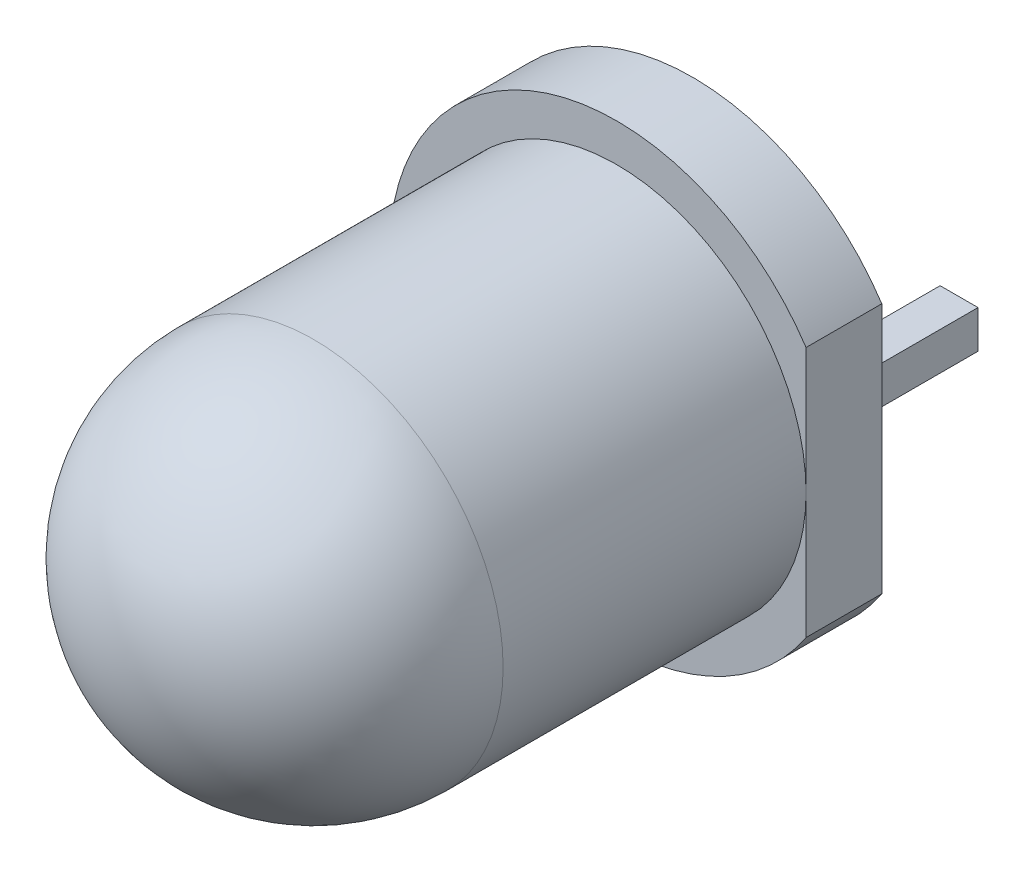
ISO-10303-21;
HEADER;
FILE_DESCRIPTION(('STEP AP214'),'2;1');
FILE_NAME('part.step','',(''),(''),'','','');
FILE_SCHEMA(('AUTOMOTIVE_DESIGN { 1 0 10303 214 1 1 1 1 }'));
ENDSEC;
DATA;
#1=APPLICATION_CONTEXT('core data for automotive mechanical design processes');
#2=APPLICATION_PROTOCOL_DEFINITION('international standard','automotive_design',2000,#1);
#3=PRODUCT_CONTEXT('',#1,'mechanical');
#4=PRODUCT('Part','Part','',(#3));
#5=PRODUCT_RELATED_PRODUCT_CATEGORY('part','',(#4));
#6=PRODUCT_DEFINITION_FORMATION('','',#4);
#7=PRODUCT_DEFINITION_CONTEXT('part definition',#1,'design');
#8=PRODUCT_DEFINITION('design','',#6,#7);
#9=PRODUCT_DEFINITION_SHAPE('','',#8);
#10=(LENGTH_UNIT() NAMED_UNIT(*) SI_UNIT(.MILLI.,.METRE.));
#11=(NAMED_UNIT(*) PLANE_ANGLE_UNIT() SI_UNIT($,.RADIAN.));
#12=(NAMED_UNIT(*) SI_UNIT($,.STERADIAN.) SOLID_ANGLE_UNIT());
#13=UNCERTAINTY_MEASURE_WITH_UNIT(LENGTH_MEASURE(1.E-05),#10,'distance_accuracy_value','');
#14=(GEOMETRIC_REPRESENTATION_CONTEXT(3) GLOBAL_UNCERTAINTY_ASSIGNED_CONTEXT((#13)) GLOBAL_UNIT_ASSIGNED_CONTEXT((#10,
#11,#12)) REPRESENTATION_CONTEXT('',''));
#15=CARTESIAN_POINT('',(0.,0.,0.));
#16=DIRECTION('',(0.,0.,1.));
#17=DIRECTION('',(1.,0.,0.));
#18=AXIS2_PLACEMENT_3D('',#15,#16,#17);
#19=CARTESIAN_POINT('',(1.77,0.25,0.));
#20=DIRECTION('',(-1.,0.,0.));
#21=DIRECTION('',(0.,-1.,0.));
#22=AXIS2_PLACEMENT_3D('',#19,#20,#21);
#23=PLANE('',#22);
#24=DIRECTION('',(0.,0.,-1.));
#25=VECTOR('',#24,1.);
#26=CARTESIAN_POINT('',(1.77,-0.25,0.));
#27=LINE('',#26,#25);
#28=CARTESIAN_POINT('',(1.77,-0.25,0.));
#29=VERTEX_POINT('',#28);
#30=CARTESIAN_POINT('',(1.77,-0.25,-2.));
#31=VERTEX_POINT('',#30);
#32=EDGE_CURVE('E114',#29,#31,#27,.T.);
#33=ORIENTED_EDGE('',*,*,#32,.T.);
#34=DIRECTION('',(0.,-1.,0.));
#35=VECTOR('',#34,1.);
#36=CARTESIAN_POINT('',(1.77,0.25,-2.));
#37=LINE('',#36,#35);
#38=CARTESIAN_POINT('',(1.77,0.25,-2.));
#39=VERTEX_POINT('',#38);
#40=EDGE_CURVE('E12',#39,#31,#37,.T.);
#41=ORIENTED_EDGE('',*,*,#40,.F.);
#42=DIRECTION('',(0.,0.,-1.));
#43=VECTOR('',#42,1.);
#44=CARTESIAN_POINT('',(1.77,0.25,0.));
#45=LINE('',#44,#43);
#46=CARTESIAN_POINT('',(1.77,0.25,0.));
#47=VERTEX_POINT('',#46);
#48=EDGE_CURVE('E91',#47,#39,#45,.T.);
#49=ORIENTED_EDGE('',*,*,#48,.F.);
#50=DIRECTION('',(0.,-1.,0.));
#51=VECTOR('',#50,1.);
#52=CARTESIAN_POINT('',(1.77,0.25,0.));
#53=LINE('',#52,#51);
#54=EDGE_CURVE('E67',#47,#29,#53,.T.);
#55=ORIENTED_EDGE('',*,*,#54,.T.);
#56=EDGE_LOOP('',(#33,#41,#49,#55));
#57=FACE_BOUND('',#56,.T.);
#58=ADVANCED_FACE('F51',(#57),#23,.F.);
#59=CARTESIAN_POINT('',(1.27,0.25,-2.));
#60=DIRECTION('',(0.,0.,-1.));
#61=DIRECTION('',(-1.,0.,0.));
#62=AXIS2_PLACEMENT_3D('',#59,#60,#61);
#63=PLANE('',#62);
#64=DIRECTION('',(1.,0.,0.));
#65=VECTOR('',#64,1.);
#66=CARTESIAN_POINT('',(1.27,-0.25,-2.));
#67=LINE('',#66,#65);
#68=CARTESIAN_POINT('',(1.27,-0.25,-2.));
#69=VERTEX_POINT('',#68);
#70=EDGE_CURVE('E100',#69,#31,#67,.T.);
#71=ORIENTED_EDGE('',*,*,#70,.F.);
#72=DIRECTION('',(0.,-1.,0.));
#73=VECTOR('',#72,1.);
#74=CARTESIAN_POINT('',(1.27,0.25,-2.));
#75=LINE('',#74,#73);
#76=CARTESIAN_POINT('',(1.27,0.25,-2.));
#77=VERTEX_POINT('',#76);
#78=EDGE_CURVE('E59',#77,#69,#75,.T.);
#79=ORIENTED_EDGE('',*,*,#78,.F.);
#80=DIRECTION('',(1.,0.,0.));
#81=VECTOR('',#80,1.);
#82=CARTESIAN_POINT('',(1.27,0.25,-2.));
#83=LINE('',#82,#81);
#84=EDGE_CURVE('E98',#77,#39,#83,.T.);
#85=ORIENTED_EDGE('',*,*,#84,.T.);
#86=ORIENTED_EDGE('',*,*,#40,.T.);
#87=EDGE_LOOP('',(#71,#79,#85,#86));
#88=FACE_BOUND('',#87,.T.);
#89=ADVANCED_FACE('F97',(#88),#63,.T.);
#90=CARTESIAN_POINT('',(1.27,0.25,0.));
#91=DIRECTION('',(-1.,0.,0.));
#92=DIRECTION('',(0.,-1.,0.));
#93=AXIS2_PLACEMENT_3D('',#90,#91,#92);
#94=PLANE('',#93);
#95=DIRECTION('',(0.,0.,-1.));
#96=VECTOR('',#95,1.);
#97=CARTESIAN_POINT('',(1.27,-0.25,0.));
#98=LINE('',#97,#96);
#99=CARTESIAN_POINT('',(1.27,-0.25,0.));
#100=VERTEX_POINT('',#99);
#101=EDGE_CURVE('E117',#100,#69,#98,.T.);
#102=ORIENTED_EDGE('',*,*,#101,.F.);
#103=DIRECTION('',(0.,-1.,0.));
#104=VECTOR('',#103,1.);
#105=CARTESIAN_POINT('',(1.27,0.25,0.));
#106=LINE('',#105,#104);
#107=CARTESIAN_POINT('',(1.27,0.25,0.));
#108=VERTEX_POINT('',#107);
#109=EDGE_CURVE('E80',#108,#100,#106,.T.);
#110=ORIENTED_EDGE('',*,*,#109,.F.);
#111=DIRECTION('',(0.,0.,-1.));
#112=VECTOR('',#111,1.);
#113=CARTESIAN_POINT('',(1.27,0.25,0.));
#114=LINE('',#113,#112);
#115=EDGE_CURVE('E106',#108,#77,#114,.T.);
#116=ORIENTED_EDGE('',*,*,#115,.T.);
#117=ORIENTED_EDGE('',*,*,#78,.T.);
#118=EDGE_LOOP('',(#102,#110,#116,#117));
#119=FACE_BOUND('',#118,.T.);
#120=ADVANCED_FACE('F108',(#119),#94,.T.);
#121=CARTESIAN_POINT('',(1.77,0.25,0.));
#122=DIRECTION('',(0.,0.,1.));
#123=DIRECTION('',(1.,0.,0.));
#124=AXIS2_PLACEMENT_3D('',#121,#122,#123);
#125=PLANE('',#124);
#126=DIRECTION('',(-1.,0.,0.));
#127=VECTOR('',#126,1.);
#128=CARTESIAN_POINT('',(1.77,-0.25,0.));
#129=LINE('',#128,#127);
#130=EDGE_CURVE('E119',#29,#100,#129,.T.);
#131=ORIENTED_EDGE('',*,*,#130,.F.);
#132=ORIENTED_EDGE('',*,*,#54,.F.);
#133=DIRECTION('',(-1.,0.,0.));
#134=VECTOR('',#133,1.);
#135=CARTESIAN_POINT('',(1.77,0.25,0.));
#136=LINE('',#135,#134);
#137=EDGE_CURVE('E109',#47,#108,#136,.T.);
#138=ORIENTED_EDGE('',*,*,#137,.T.);
#139=ORIENTED_EDGE('',*,*,#109,.T.);
#140=EDGE_LOOP('',(#131,#132,#138,#139));
#141=FACE_BOUND('',#140,.T.);
#142=ADVANCED_FACE('F125',(#141),#125,.T.);
#143=CARTESIAN_POINT('',(0.,0.25,0.));
#144=DIRECTION('',(0.,-1.,0.));
#145=DIRECTION('',(-1.,0.,0.));
#146=AXIS2_PLACEMENT_3D('',#143,#144,#145);
#147=PLANE('',#146);
#148=ORIENTED_EDGE('',*,*,#48,.T.);
#149=ORIENTED_EDGE('',*,*,#84,.F.);
#150=ORIENTED_EDGE('',*,*,#115,.F.);
#151=ORIENTED_EDGE('',*,*,#137,.F.);
#152=EDGE_LOOP('',(#148,#149,#150,#151));
#153=FACE_BOUND('',#152,.T.);
#154=ADVANCED_FACE('F105',(#153),#147,.F.);
#155=CARTESIAN_POINT('',(0.,-0.25,0.));
#156=DIRECTION('',(0.,-1.,0.));
#157=DIRECTION('',(-1.,0.,0.));
#158=AXIS2_PLACEMENT_3D('',#155,#156,#157);
#159=PLANE('',#158);
#160=ORIENTED_EDGE('',*,*,#32,.F.);
#161=ORIENTED_EDGE('',*,*,#130,.T.);
#162=ORIENTED_EDGE('',*,*,#101,.T.);
#163=ORIENTED_EDGE('',*,*,#70,.T.);
#164=EDGE_LOOP('',(#160,#161,#162,#163));
#165=FACE_BOUND('',#164,.T.);
#166=ADVANCED_FACE('F124',(#165),#159,.T.);
#167=CLOSED_SHELL('',(#58,#89,#120,#142,#154,#166));
#168=MANIFOLD_SOLID_BREP('B2',#167);
#169=CARTESIAN_POINT('',(-0.77,0.25,0.));
#170=DIRECTION('',(-1.,0.,0.));
#171=DIRECTION('',(0.,-1.,0.));
#172=AXIS2_PLACEMENT_3D('',#169,#170,#171);
#173=PLANE('',#172);
#174=DIRECTION('',(0.,0.,-1.));
#175=VECTOR('',#174,1.);
#176=CARTESIAN_POINT('',(-0.77,-0.25,0.));
#177=LINE('',#176,#175);
#178=CARTESIAN_POINT('',(-0.77,-0.25,0.));
#179=VERTEX_POINT('',#178);
#180=CARTESIAN_POINT('',(-0.77,-0.25,-2.));
#181=VERTEX_POINT('',#180);
#182=EDGE_CURVE('E260',#179,#181,#177,.T.);
#183=ORIENTED_EDGE('',*,*,#182,.T.);
#184=DIRECTION('',(0.,-1.,0.));
#185=VECTOR('',#184,1.);
#186=CARTESIAN_POINT('',(-0.77,0.25,-2.));
#187=LINE('',#186,#185);
#188=CARTESIAN_POINT('',(-0.77,0.25,-2.));
#189=VERTEX_POINT('',#188);
#190=EDGE_CURVE('E49',#189,#181,#187,.T.);
#191=ORIENTED_EDGE('',*,*,#190,.F.);
#192=DIRECTION('',(0.,0.,-1.));
#193=VECTOR('',#192,1.);
#194=CARTESIAN_POINT('',(-0.77,0.25,0.));
#195=LINE('',#194,#193);
#196=CARTESIAN_POINT('',(-0.77,0.25,0.));
#197=VERTEX_POINT('',#196);
#198=EDGE_CURVE('E237',#197,#189,#195,.T.);
#199=ORIENTED_EDGE('',*,*,#198,.F.);
#200=DIRECTION('',(0.,-1.,0.));
#201=VECTOR('',#200,1.);
#202=CARTESIAN_POINT('',(-0.77,0.25,0.));
#203=LINE('',#202,#201);
#204=EDGE_CURVE('E213',#197,#179,#203,.T.);
#205=ORIENTED_EDGE('',*,*,#204,.T.);
#206=EDGE_LOOP('',(#183,#191,#199,#205));
#207=FACE_BOUND('',#206,.T.);
#208=ADVANCED_FACE('F197',(#207),#173,.F.);
#209=CARTESIAN_POINT('',(-1.27,0.25,-2.));
#210=DIRECTION('',(0.,0.,-1.));
#211=DIRECTION('',(-1.,0.,0.));
#212=AXIS2_PLACEMENT_3D('',#209,#210,#211);
#213=PLANE('',#212);
#214=DIRECTION('',(1.,0.,0.));
#215=VECTOR('',#214,1.);
#216=CARTESIAN_POINT('',(-1.27,-0.25,-2.));
#217=LINE('',#216,#215);
#218=CARTESIAN_POINT('',(-1.27,-0.25,-2.));
#219=VERTEX_POINT('',#218);
#220=EDGE_CURVE('E246',#219,#181,#217,.T.);
#221=ORIENTED_EDGE('',*,*,#220,.F.);
#222=DIRECTION('',(0.,-1.,0.));
#223=VECTOR('',#222,1.);
#224=CARTESIAN_POINT('',(-1.27,0.25,-2.));
#225=LINE('',#224,#223);
#226=CARTESIAN_POINT('',(-1.27,0.25,-2.));
#227=VERTEX_POINT('',#226);
#228=EDGE_CURVE('E205',#227,#219,#225,.T.);
#229=ORIENTED_EDGE('',*,*,#228,.F.);
#230=DIRECTION('',(1.,0.,0.));
#231=VECTOR('',#230,1.);
#232=CARTESIAN_POINT('',(-1.27,0.25,-2.));
#233=LINE('',#232,#231);
#234=EDGE_CURVE('E244',#227,#189,#233,.T.);
#235=ORIENTED_EDGE('',*,*,#234,.T.);
#236=ORIENTED_EDGE('',*,*,#190,.T.);
#237=EDGE_LOOP('',(#221,#229,#235,#236));
#238=FACE_BOUND('',#237,.T.);
#239=ADVANCED_FACE('F243',(#238),#213,.T.);
#240=CARTESIAN_POINT('',(-1.27,0.25,0.));
#241=DIRECTION('',(-1.,0.,0.));
#242=DIRECTION('',(0.,-1.,0.));
#243=AXIS2_PLACEMENT_3D('',#240,#241,#242);
#244=PLANE('',#243);
#245=DIRECTION('',(0.,0.,-1.));
#246=VECTOR('',#245,1.);
#247=CARTESIAN_POINT('',(-1.27,-0.25,0.));
#248=LINE('',#247,#246);
#249=CARTESIAN_POINT('',(-1.27,-0.25,0.));
#250=VERTEX_POINT('',#249);
#251=EDGE_CURVE('E263',#250,#219,#248,.T.);
#252=ORIENTED_EDGE('',*,*,#251,.F.);
#253=DIRECTION('',(0.,-1.,0.));
#254=VECTOR('',#253,1.);
#255=CARTESIAN_POINT('',(-1.27,0.25,0.));
#256=LINE('',#255,#254);
#257=CARTESIAN_POINT('',(-1.27,0.25,0.));
#258=VERTEX_POINT('',#257);
#259=EDGE_CURVE('E226',#258,#250,#256,.T.);
#260=ORIENTED_EDGE('',*,*,#259,.F.);
#261=DIRECTION('',(0.,0.,-1.));
#262=VECTOR('',#261,1.);
#263=CARTESIAN_POINT('',(-1.27,0.25,0.));
#264=LINE('',#263,#262);
#265=EDGE_CURVE('E252',#258,#227,#264,.T.);
#266=ORIENTED_EDGE('',*,*,#265,.T.);
#267=ORIENTED_EDGE('',*,*,#228,.T.);
#268=EDGE_LOOP('',(#252,#260,#266,#267));
#269=FACE_BOUND('',#268,.T.);
#270=ADVANCED_FACE('F254',(#269),#244,.T.);
#271=CARTESIAN_POINT('',(-0.77,0.25,0.));
#272=DIRECTION('',(0.,0.,1.));
#273=DIRECTION('',(1.,0.,0.));
#274=AXIS2_PLACEMENT_3D('',#271,#272,#273);
#275=PLANE('',#274);
#276=DIRECTION('',(-1.,0.,0.));
#277=VECTOR('',#276,1.);
#278=CARTESIAN_POINT('',(-0.77,-0.25,0.));
#279=LINE('',#278,#277);
#280=EDGE_CURVE('E265',#179,#250,#279,.T.);
#281=ORIENTED_EDGE('',*,*,#280,.F.);
#282=ORIENTED_EDGE('',*,*,#204,.F.);
#283=DIRECTION('',(-1.,0.,0.));
#284=VECTOR('',#283,1.);
#285=CARTESIAN_POINT('',(-0.77,0.25,0.));
#286=LINE('',#285,#284);
#287=EDGE_CURVE('E255',#197,#258,#286,.T.);
#288=ORIENTED_EDGE('',*,*,#287,.T.);
#289=ORIENTED_EDGE('',*,*,#259,.T.);
#290=EDGE_LOOP('',(#281,#282,#288,#289));
#291=FACE_BOUND('',#290,.T.);
#292=ADVANCED_FACE('F271',(#291),#275,.T.);
#293=CARTESIAN_POINT('',(0.,0.25,0.));
#294=DIRECTION('',(0.,-1.,0.));
#295=DIRECTION('',(-1.,0.,0.));
#296=AXIS2_PLACEMENT_3D('',#293,#294,#295);
#297=PLANE('',#296);
#298=ORIENTED_EDGE('',*,*,#198,.T.);
#299=ORIENTED_EDGE('',*,*,#234,.F.);
#300=ORIENTED_EDGE('',*,*,#265,.F.);
#301=ORIENTED_EDGE('',*,*,#287,.F.);
#302=EDGE_LOOP('',(#298,#299,#300,#301));
#303=FACE_BOUND('',#302,.T.);
#304=ADVANCED_FACE('F251',(#303),#297,.F.);
#305=CARTESIAN_POINT('',(0.,-0.25,0.));
#306=DIRECTION('',(0.,-1.,0.));
#307=DIRECTION('',(-1.,0.,0.));
#308=AXIS2_PLACEMENT_3D('',#305,#306,#307);
#309=PLANE('',#308);
#310=ORIENTED_EDGE('',*,*,#182,.F.);
#311=ORIENTED_EDGE('',*,*,#280,.T.);
#312=ORIENTED_EDGE('',*,*,#251,.T.);
#313=ORIENTED_EDGE('',*,*,#220,.T.);
#314=EDGE_LOOP('',(#310,#311,#312,#313));
#315=FACE_BOUND('',#314,.T.);
#316=ADVANCED_FACE('F270',(#315),#309,.T.);
#317=CLOSED_SHELL('',(#208,#239,#270,#292,#304,#316));
#318=MANIFOLD_SOLID_BREP('B6',#317);
#319=CARTESIAN_POINT('',(0.,0.,1.));
#320=DIRECTION('',(0.,0.,1.));
#321=DIRECTION('',(1.,0.,0.));
#322=AXIS2_PLACEMENT_3D('',#319,#320,#321);
#323=PLANE('',#322);
#324=DIRECTION('',(0.,-1.,0.));
#325=VECTOR('',#324,1.);
#326=CARTESIAN_POINT('',(2.5,1.85027574752907,1.));
#327=LINE('',#326,#325);
#328=CARTESIAN_POINT('',(2.5,1.6583123951777,1.));
#329=VERTEX_POINT('',#328);
#330=CARTESIAN_POINT('',(2.5,0.,1.));
#331=VERTEX_POINT('',#330);
#332=EDGE_CURVE('E361',#329,#331,#327,.T.);
#333=ORIENTED_EDGE('',*,*,#332,.F.);
#334=CARTESIAN_POINT('',(0.,0.,1.));
#335=DIRECTION('',(0.,0.,1.));
#336=DIRECTION('',(1.,0.,0.));
#337=AXIS2_PLACEMENT_3D('',#334,#335,#336);
#338=CIRCLE('',#337,3.);
#339=CARTESIAN_POINT('',(2.5,-1.6583123951777,1.));
#340=VERTEX_POINT('',#339);
#341=EDGE_CURVE('E195',#329,#340,#338,.T.);
#342=ORIENTED_EDGE('',*,*,#341,.T.);
#343=EDGE_CURVE('E381',#331,#340,#327,.T.);
#344=ORIENTED_EDGE('',*,*,#343,.F.);
#345=CARTESIAN_POINT('',(0.,0.,1.));
#346=DIRECTION('',(0.,0.,1.));
#347=DIRECTION('',(1.,0.,0.));
#348=AXIS2_PLACEMENT_3D('',#345,#346,#347);
#349=CIRCLE('',#348,2.5);
#350=EDGE_CURVE('E380',#331,#331,#349,.T.);
#351=ORIENTED_EDGE('',*,*,#350,.F.);
#352=EDGE_LOOP('',(#333,#342,#344,#351));
#353=FACE_BOUND('',#352,.T.);
#354=ADVANCED_FACE('F338',(#353),#323,.T.);
#355=CARTESIAN_POINT('',(0.,0.,1.));
#356=DIRECTION('',(0.,0.,-1.));
#357=DIRECTION('',(-1.,0.,0.));
#358=AXIS2_PLACEMENT_3D('',#355,#356,#357);
#359=CYLINDRICAL_SURFACE('',#358,3.);
#360=ORIENTED_EDGE('',*,*,#341,.F.);
#361=DIRECTION('',(0.,0.,-1.));
#362=VECTOR('',#361,1.);
#363=CARTESIAN_POINT('',(2.5,1.6583123951777,1.));
#364=LINE('',#363,#362);
#365=CARTESIAN_POINT('',(2.5,1.6583123951777,0.));
#366=VERTEX_POINT('',#365);
#367=EDGE_CURVE('E369',#366,#329,#364,.F.);
#368=ORIENTED_EDGE('',*,*,#367,.F.);
#369=CARTESIAN_POINT('',(0.,0.,0.));
#370=DIRECTION('',(0.,0.,1.));
#371=DIRECTION('',(1.,0.,0.));
#372=AXIS2_PLACEMENT_3D('',#369,#370,#371);
#373=CIRCLE('',#372,3.);
#374=CARTESIAN_POINT('',(2.5,-1.6583123951777,0.));
#375=VERTEX_POINT('',#374);
#376=EDGE_CURVE('E347',#366,#375,#373,.T.);
#377=ORIENTED_EDGE('',*,*,#376,.T.);
#378=DIRECTION('',(0.,0.,-1.));
#379=VECTOR('',#378,1.);
#380=CARTESIAN_POINT('',(2.5,-1.6583123951777,1.));
#381=LINE('',#380,#379);
#382=EDGE_CURVE('E355',#340,#375,#381,.T.);
#383=ORIENTED_EDGE('',*,*,#382,.F.);
#384=EDGE_LOOP('',(#360,#368,#377,#383));
#385=FACE_BOUND('',#384,.T.);
#386=ADVANCED_FACE('F383',(#385),#359,.T.);
#387=CARTESIAN_POINT('',(0.,0.,0.));
#388=DIRECTION('',(0.,0.,1.));
#389=DIRECTION('',(1.,0.,0.));
#390=AXIS2_PLACEMENT_3D('',#387,#388,#389);
#391=PLANE('',#390);
#392=ORIENTED_EDGE('',*,*,#376,.F.);
#393=DIRECTION('',(0.,1.,0.));
#394=VECTOR('',#393,1.);
#395=CARTESIAN_POINT('',(2.5,1.85027574752907,0.));
#396=LINE('',#395,#394);
#397=EDGE_CURVE('E371',#375,#366,#396,.T.);
#398=ORIENTED_EDGE('',*,*,#397,.F.);
#399=EDGE_LOOP('',(#392,#398));
#400=FACE_BOUND('',#399,.T.);
#401=ADVANCED_FACE('F394',(#400),#391,.F.);
#402=CARTESIAN_POINT('',(0.,0.,5.));
#403=DIRECTION('',(0.,0.,-1.));
#404=DIRECTION('',(-1.,0.,0.));
#405=AXIS2_PLACEMENT_3D('',#402,#403,#404);
#406=CYLINDRICAL_SURFACE('',#405,2.5);
#407=CARTESIAN_POINT('',(0.,0.,5.));
#408=DIRECTION('',(0.,0.,1.));
#409=DIRECTION('',(1.,0.,0.));
#410=AXIS2_PLACEMENT_3D('',#407,#408,#409);
#411=CIRCLE('',#410,2.5);
#412=CARTESIAN_POINT('',(2.5,0.,5.));
#413=VERTEX_POINT('',#412);
#414=EDGE_CURVE('E342',#413,#413,#411,.T.);
#415=ORIENTED_EDGE('',*,*,#414,.F.);
#416=EDGE_LOOP('',(#415));
#417=FACE_BOUND('',#416,.T.);
#418=ORIENTED_EDGE('',*,*,#350,.T.);
#419=EDGE_LOOP('',(#418));
#420=FACE_BOUND('',#419,.T.);
#421=ADVANCED_FACE('F391',(#417,#420),#406,.T.);
#422=CARTESIAN_POINT('',(0.,0.,5.));
#423=DIRECTION('',(0.,0.,1.));
#424=DIRECTION('',(1.,0.,0.));
#425=AXIS2_PLACEMENT_3D('',#422,#423,#424);
#426=SPHERICAL_SURFACE('',#425,2.5);
#427=ORIENTED_EDGE('',*,*,#414,.T.);
#428=EDGE_LOOP('',(#427));
#429=FACE_BOUND('',#428,.T.);
#430=ADVANCED_FACE('F340',(#429),#426,.T.);
#431=CARTESIAN_POINT('',(2.5,1.85027574752907,-0.000999999999999916));
#432=DIRECTION('',(-1.,0.,0.));
#433=DIRECTION('',(0.,-1.,0.));
#434=AXIS2_PLACEMENT_3D('',#431,#432,#433);
#435=PLANE('',#434);
#436=ORIENTED_EDGE('',*,*,#367,.T.);
#437=ORIENTED_EDGE('',*,*,#332,.T.);
#438=ORIENTED_EDGE('',*,*,#343,.T.);
#439=ORIENTED_EDGE('',*,*,#382,.T.);
#440=ORIENTED_EDGE('',*,*,#397,.T.);
#441=EDGE_LOOP('',(#436,#437,#438,#439,#440));
#442=FACE_BOUND('',#441,.T.);
#443=ADVANCED_FACE('F370',(#442),#435,.F.);
#444=CLOSED_SHELL('',(#354,#386,#401,#421,#430,#443));
#445=MANIFOLD_SOLID_BREP('B43',#444);
#446=ADVANCED_BREP_SHAPE_REPRESENTATION('',(#18,#168,#318,#445),#14);
#447=SHAPE_DEFINITION_REPRESENTATION(#9,#446);
ENDSEC;
END-ISO-10303-21;
